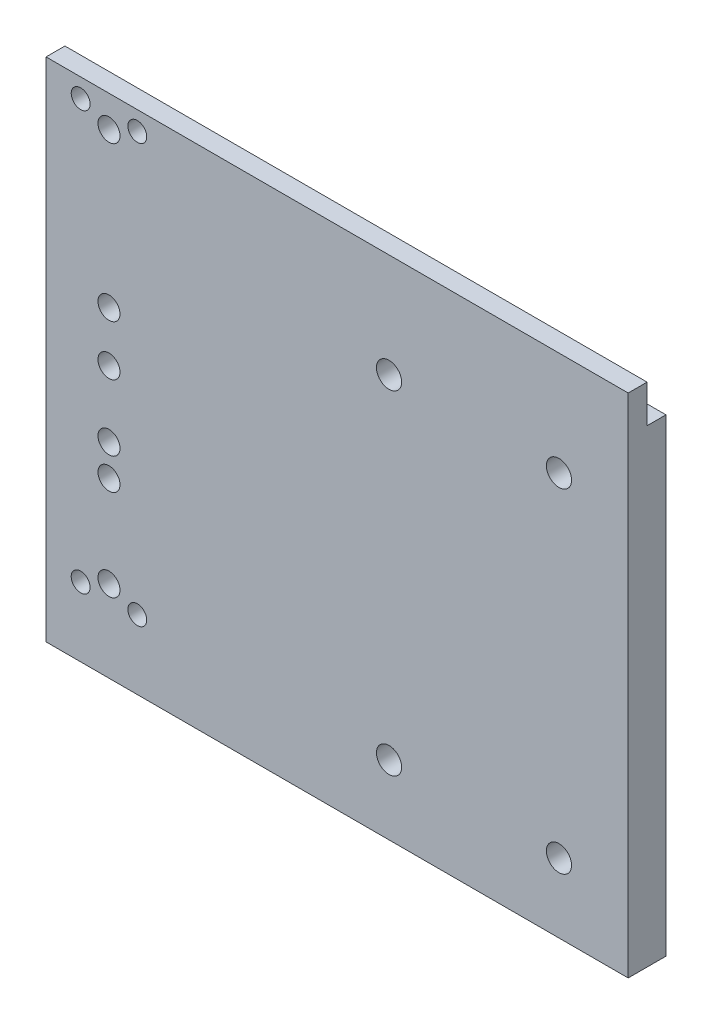
ISO-10303-21;
HEADER;
FILE_DESCRIPTION(('STEP AP214'),'2;1');
FILE_NAME('part.step','',(''),(''),'','','');
FILE_SCHEMA(('AUTOMOTIVE_DESIGN { 1 0 10303 214 1 1 1 1 }'));
ENDSEC;
DATA;
#1=APPLICATION_CONTEXT('core data for automotive mechanical design processes');
#2=APPLICATION_PROTOCOL_DEFINITION('international standard','automotive_design',2000,#1);
#3=PRODUCT_CONTEXT('',#1,'mechanical');
#4=PRODUCT('Part','Part','',(#3));
#5=PRODUCT_RELATED_PRODUCT_CATEGORY('part','',(#4));
#6=PRODUCT_DEFINITION_FORMATION('','',#4);
#7=PRODUCT_DEFINITION_CONTEXT('part definition',#1,'design');
#8=PRODUCT_DEFINITION('design','',#6,#7);
#9=PRODUCT_DEFINITION_SHAPE('','',#8);
#10=(LENGTH_UNIT() NAMED_UNIT(*) SI_UNIT(.MILLI.,.METRE.));
#11=(NAMED_UNIT(*) PLANE_ANGLE_UNIT() SI_UNIT($,.RADIAN.));
#12=(NAMED_UNIT(*) SI_UNIT($,.STERADIAN.) SOLID_ANGLE_UNIT());
#13=UNCERTAINTY_MEASURE_WITH_UNIT(LENGTH_MEASURE(1.E-05),#10,'distance_accuracy_value','');
#14=(GEOMETRIC_REPRESENTATION_CONTEXT(3) GLOBAL_UNCERTAINTY_ASSIGNED_CONTEXT((#13)) GLOBAL_UNIT_ASSIGNED_CONTEXT((#10,
#11,#12)) REPRESENTATION_CONTEXT('',''));
#15=CARTESIAN_POINT('',(0.,0.,0.));
#16=DIRECTION('',(0.,0.,1.));
#17=DIRECTION('',(1.,0.,0.));
#18=AXIS2_PLACEMENT_3D('',#15,#16,#17);
#19=CARTESIAN_POINT('',(0.,0.,-6.));
#20=DIRECTION('',(-1.,0.,0.));
#21=DIRECTION('',(0.,0.,1.));
#22=AXIS2_PLACEMENT_3D('',#19,#20,#21);
#23=PLANE('',#22);
#24=DIRECTION('',(0.,-1.,0.));
#25=VECTOR('',#24,1.);
#26=CARTESIAN_POINT('',(0.,0.,0.));
#27=LINE('',#26,#25);
#28=CARTESIAN_POINT('',(0.,149.,0.));
#29=VERTEX_POINT('',#28);
#30=CARTESIAN_POINT('',(0.,0.,0.));
#31=VERTEX_POINT('',#30);
#32=EDGE_CURVE('E78',#29,#31,#27,.T.);
#33=ORIENTED_EDGE('',*,*,#32,.F.);
#34=DIRECTION('',(0.,0.,1.));
#35=VECTOR('',#34,1.);
#36=CARTESIAN_POINT('',(0.,149.,-6.));
#37=LINE('',#36,#35);
#38=CARTESIAN_POINT('',(0.,149.,-6.));
#39=VERTEX_POINT('',#38);
#40=EDGE_CURVE('E12',#39,#29,#37,.T.);
#41=ORIENTED_EDGE('',*,*,#40,.F.);
#42=DIRECTION('',(0.,-1.,0.));
#43=VECTOR('',#42,1.);
#44=CARTESIAN_POINT('',(0.,0.,-6.));
#45=LINE('',#44,#43);
#46=CARTESIAN_POINT('',(0.,0.,-6.));
#47=VERTEX_POINT('',#46);
#48=EDGE_CURVE('E114',#39,#47,#45,.T.);
#49=ORIENTED_EDGE('',*,*,#48,.T.);
#50=DIRECTION('',(0.,0.,1.));
#51=VECTOR('',#50,1.);
#52=CARTESIAN_POINT('',(0.,0.,-6.));
#53=LINE('',#52,#51);
#54=EDGE_CURVE('E49',#47,#31,#53,.T.);
#55=ORIENTED_EDGE('',*,*,#54,.T.);
#56=EDGE_LOOP('',(#33,#41,#49,#55));
#57=FACE_BOUND('',#56,.T.);
#58=ADVANCED_FACE('F46',(#57),#23,.T.);
#59=CARTESIAN_POINT('',(0.,149.,-6.));
#60=DIRECTION('',(0.,1.,0.));
#61=DIRECTION('',(0.,0.,1.));
#62=AXIS2_PLACEMENT_3D('',#59,#60,#61);
#63=PLANE('',#62);
#64=DIRECTION('',(-1.,0.,0.));
#65=VECTOR('',#64,1.);
#66=CARTESIAN_POINT('',(0.,149.,0.));
#67=LINE('',#66,#65);
#68=CARTESIAN_POINT('',(97.,149.,0.));
#69=VERTEX_POINT('',#68);
#70=EDGE_CURVE('E117',#69,#29,#67,.T.);
#71=ORIENTED_EDGE('',*,*,#70,.F.);
#72=DIRECTION('',(0.,0.,1.));
#73=VECTOR('',#72,1.);
#74=CARTESIAN_POINT('',(97.,149.,-6.));
#75=LINE('',#74,#73);
#76=CARTESIAN_POINT('',(97.,149.,-6.));
#77=VERTEX_POINT('',#76);
#78=EDGE_CURVE('E56',#77,#69,#75,.T.);
#79=ORIENTED_EDGE('',*,*,#78,.F.);
#80=DIRECTION('',(-1.,0.,0.));
#81=VECTOR('',#80,1.);
#82=CARTESIAN_POINT('',(0.,149.,-6.));
#83=LINE('',#82,#81);
#84=EDGE_CURVE('E108',#77,#39,#83,.T.);
#85=ORIENTED_EDGE('',*,*,#84,.T.);
#86=ORIENTED_EDGE('',*,*,#40,.T.);
#87=EDGE_LOOP('',(#71,#79,#85,#86));
#88=FACE_BOUND('',#87,.T.);
#89=ADVANCED_FACE('F137',(#88),#63,.T.);
#90=CARTESIAN_POINT('',(97.,0.,-6.));
#91=DIRECTION('',(1.,0.,0.));
#92=DIRECTION('',(0.,0.,-1.));
#93=AXIS2_PLACEMENT_3D('',#90,#91,#92);
#94=PLANE('',#93);
#95=ORIENTED_EDGE('',*,*,#78,.T.);
#96=DIRECTION('',(0.,-1.,0.));
#97=VECTOR('',#96,1.);
#98=CARTESIAN_POINT('',(97.,0.,0.));
#99=LINE('',#98,#97);
#100=CARTESIAN_POINT('',(97.,161.,0.));
#101=VERTEX_POINT('',#100);
#102=EDGE_CURVE('E134',#101,#69,#99,.T.);
#103=ORIENTED_EDGE('',*,*,#102,.F.);
#104=DIRECTION('',(0.,0.,-1.));
#105=VECTOR('',#104,1.);
#106=CARTESIAN_POINT('',(97.,161.,6.));
#107=LINE('',#106,#105);
#108=CARTESIAN_POINT('',(97.,161.,6.));
#109=VERTEX_POINT('',#108);
#110=EDGE_CURVE('E171',#109,#101,#107,.T.);
#111=ORIENTED_EDGE('',*,*,#110,.F.);
#112=DIRECTION('',(0.,-1.,0.));
#113=VECTOR('',#112,1.);
#114=CARTESIAN_POINT('',(97.,0.,6.));
#115=LINE('',#114,#113);
#116=CARTESIAN_POINT('',(97.,0.,6.));
#117=VERTEX_POINT('',#116);
#118=EDGE_CURVE('E97',#109,#117,#115,.T.);
#119=ORIENTED_EDGE('',*,*,#118,.T.);
#120=DIRECTION('',(0.,0.,1.));
#121=VECTOR('',#120,1.);
#122=CARTESIAN_POINT('',(97.,0.,-6.));
#123=LINE('',#122,#121);
#124=CARTESIAN_POINT('',(97.,0.,-6.));
#125=VERTEX_POINT('',#124);
#126=EDGE_CURVE('E90',#125,#117,#123,.T.);
#127=ORIENTED_EDGE('',*,*,#126,.F.);
#128=DIRECTION('',(0.,1.,0.));
#129=VECTOR('',#128,1.);
#130=CARTESIAN_POINT('',(97.,0.,-6.));
#131=LINE('',#130,#129);
#132=EDGE_CURVE('E93',#125,#77,#131,.T.);
#133=ORIENTED_EDGE('',*,*,#132,.T.);
#134=EDGE_LOOP('',(#95,#103,#111,#119,#127,#133));
#135=FACE_BOUND('',#134,.T.);
#136=ADVANCED_FACE('F92',(#135),#94,.T.);
#137=CARTESIAN_POINT('',(0.,0.,-6.));
#138=DIRECTION('',(0.,-1.,0.));
#139=DIRECTION('',(0.,0.,-1.));
#140=AXIS2_PLACEMENT_3D('',#137,#138,#139);
#141=PLANE('',#140);
#142=ORIENTED_EDGE('',*,*,#126,.T.);
#143=DIRECTION('',(1.,0.,0.));
#144=VECTOR('',#143,1.);
#145=CARTESIAN_POINT('',(0.,0.,6.));
#146=LINE('',#145,#144);
#147=CARTESIAN_POINT('',(-88.,0.,6.));
#148=VERTEX_POINT('',#147);
#149=EDGE_CURVE('E167',#148,#117,#146,.T.);
#150=ORIENTED_EDGE('',*,*,#149,.F.);
#151=DIRECTION('',(0.,0.,-1.));
#152=VECTOR('',#151,1.);
#153=CARTESIAN_POINT('',(-88.,0.,6.));
#154=LINE('',#153,#152);
#155=CARTESIAN_POINT('',(-88.,0.,0.));
#156=VERTEX_POINT('',#155);
#157=EDGE_CURVE('E162',#148,#156,#154,.T.);
#158=ORIENTED_EDGE('',*,*,#157,.T.);
#159=DIRECTION('',(1.,0.,0.));
#160=VECTOR('',#159,1.);
#161=CARTESIAN_POINT('',(0.,0.,0.));
#162=LINE('',#161,#160);
#163=EDGE_CURVE('E158',#156,#31,#162,.T.);
#164=ORIENTED_EDGE('',*,*,#163,.T.);
#165=ORIENTED_EDGE('',*,*,#54,.F.);
#166=DIRECTION('',(1.,0.,0.));
#167=VECTOR('',#166,1.);
#168=CARTESIAN_POINT('',(0.,0.,-6.));
#169=LINE('',#168,#167);
#170=EDGE_CURVE('E106',#47,#125,#169,.T.);
#171=ORIENTED_EDGE('',*,*,#170,.T.);
#172=EDGE_LOOP('',(#142,#150,#158,#164,#165,#171));
#173=FACE_BOUND('',#172,.T.);
#174=ADVANCED_FACE('F111',(#173),#141,.T.);
#175=CARTESIAN_POINT('',(0.,0.,-6.));
#176=DIRECTION('',(0.,0.,-1.));
#177=DIRECTION('',(-1.,0.,0.));
#178=AXIS2_PLACEMENT_3D('',#175,#176,#177);
#179=PLANE('',#178);
#180=CARTESIAN_POINT('',(21.,22.,-6.));
#181=DIRECTION('',(0.,0.,1.));
#182=DIRECTION('',(1.,0.,0.));
#183=AXIS2_PLACEMENT_3D('',#180,#181,#182);
#184=CIRCLE('',#183,4.);
#185=CARTESIAN_POINT('',(25.,22.,-6.));
#186=VERTEX_POINT('',#185);
#187=EDGE_CURVE('E175',#186,#186,#184,.T.);
#188=ORIENTED_EDGE('',*,*,#187,.T.);
#189=EDGE_LOOP('',(#188));
#190=FACE_BOUND('',#189,.T.);
#191=CARTESIAN_POINT('',(75.,22.,-6.));
#192=DIRECTION('',(0.,0.,1.));
#193=DIRECTION('',(1.,0.,0.));
#194=AXIS2_PLACEMENT_3D('',#191,#192,#193);
#195=CIRCLE('',#194,4.00000000000001);
#196=CARTESIAN_POINT('',(79.,22.,-6.));
#197=VERTEX_POINT('',#196);
#198=EDGE_CURVE('E179',#197,#197,#195,.T.);
#199=ORIENTED_EDGE('',*,*,#198,.T.);
#200=EDGE_LOOP('',(#199));
#201=FACE_BOUND('',#200,.T.);
#202=CARTESIAN_POINT('',(75.,128.,-6.));
#203=DIRECTION('',(0.,0.,1.));
#204=DIRECTION('',(1.,0.,0.));
#205=AXIS2_PLACEMENT_3D('',#202,#203,#204);
#206=CIRCLE('',#205,4.00000000000001);
#207=CARTESIAN_POINT('',(79.,128.,-6.));
#208=VERTEX_POINT('',#207);
#209=EDGE_CURVE('E183',#208,#208,#206,.T.);
#210=ORIENTED_EDGE('',*,*,#209,.T.);
#211=EDGE_LOOP('',(#210));
#212=FACE_BOUND('',#211,.T.);
#213=CARTESIAN_POINT('',(21.,128.,-6.));
#214=DIRECTION('',(0.,0.,1.));
#215=DIRECTION('',(1.,0.,0.));
#216=AXIS2_PLACEMENT_3D('',#213,#214,#215);
#217=CIRCLE('',#216,4.);
#218=CARTESIAN_POINT('',(25.,128.,-6.));
#219=VERTEX_POINT('',#218);
#220=EDGE_CURVE('E125',#219,#219,#217,.T.);
#221=ORIENTED_EDGE('',*,*,#220,.T.);
#222=EDGE_LOOP('',(#221));
#223=FACE_BOUND('',#222,.T.);
#224=ORIENTED_EDGE('',*,*,#48,.F.);
#225=ORIENTED_EDGE('',*,*,#84,.F.);
#226=ORIENTED_EDGE('',*,*,#132,.F.);
#227=ORIENTED_EDGE('',*,*,#170,.F.);
#228=EDGE_LOOP('',(#224,#225,#226,#227));
#229=FACE_BOUND('',#228,.T.);
#230=ADVANCED_FACE('F105',(#190,#201,#212,#223,#229),#179,.T.);
#231=CARTESIAN_POINT('',(21.,128.,-6.));
#232=DIRECTION('',(0.,0.,1.));
#233=DIRECTION('',(1.,0.,0.));
#234=AXIS2_PLACEMENT_3D('',#231,#232,#233);
#235=CYLINDRICAL_SURFACE('',#234,4.);
#236=ORIENTED_EDGE('',*,*,#220,.F.);
#237=EDGE_LOOP('',(#236));
#238=FACE_BOUND('',#237,.T.);
#239=CARTESIAN_POINT('',(21.,128.,6.));
#240=DIRECTION('',(0.,0.,1.));
#241=DIRECTION('',(1.,0.,0.));
#242=AXIS2_PLACEMENT_3D('',#239,#240,#241);
#243=CIRCLE('',#242,4.);
#244=CARTESIAN_POINT('',(25.,128.,6.));
#245=VERTEX_POINT('',#244);
#246=EDGE_CURVE('E161',#245,#245,#243,.T.);
#247=ORIENTED_EDGE('',*,*,#246,.T.);
#248=EDGE_LOOP('',(#247));
#249=FACE_BOUND('',#248,.T.);
#250=ADVANCED_FACE('F191',(#238,#249),#235,.F.);
#251=CARTESIAN_POINT('',(75.,128.,-6.));
#252=DIRECTION('',(0.,0.,1.));
#253=DIRECTION('',(1.,0.,0.));
#254=AXIS2_PLACEMENT_3D('',#251,#252,#253);
#255=CYLINDRICAL_SURFACE('',#254,4.00000000000001);
#256=ORIENTED_EDGE('',*,*,#209,.F.);
#257=EDGE_LOOP('',(#256));
#258=FACE_BOUND('',#257,.T.);
#259=CARTESIAN_POINT('',(75.,128.,6.));
#260=DIRECTION('',(0.,0.,1.));
#261=DIRECTION('',(1.,0.,0.));
#262=AXIS2_PLACEMENT_3D('',#259,#260,#261);
#263=CIRCLE('',#262,4.00000000000001);
#264=CARTESIAN_POINT('',(79.,128.,6.));
#265=VERTEX_POINT('',#264);
#266=EDGE_CURVE('E200',#265,#265,#263,.T.);
#267=ORIENTED_EDGE('',*,*,#266,.T.);
#268=EDGE_LOOP('',(#267));
#269=FACE_BOUND('',#268,.T.);
#270=ADVANCED_FACE('F194',(#258,#269),#255,.F.);
#271=CARTESIAN_POINT('',(75.,22.,-6.));
#272=DIRECTION('',(0.,0.,1.));
#273=DIRECTION('',(1.,0.,0.));
#274=AXIS2_PLACEMENT_3D('',#271,#272,#273);
#275=CYLINDRICAL_SURFACE('',#274,4.00000000000001);
#276=ORIENTED_EDGE('',*,*,#198,.F.);
#277=EDGE_LOOP('',(#276));
#278=FACE_BOUND('',#277,.T.);
#279=CARTESIAN_POINT('',(75.,22.,6.));
#280=DIRECTION('',(0.,0.,1.));
#281=DIRECTION('',(1.,0.,0.));
#282=AXIS2_PLACEMENT_3D('',#279,#280,#281);
#283=CIRCLE('',#282,4.00000000000001);
#284=CARTESIAN_POINT('',(79.,22.,6.));
#285=VERTEX_POINT('',#284);
#286=EDGE_CURVE('E204',#285,#285,#283,.T.);
#287=ORIENTED_EDGE('',*,*,#286,.T.);
#288=EDGE_LOOP('',(#287));
#289=FACE_BOUND('',#288,.T.);
#290=ADVANCED_FACE('F371',(#278,#289),#275,.F.);
#291=CARTESIAN_POINT('',(21.,22.,-6.));
#292=DIRECTION('',(0.,0.,1.));
#293=DIRECTION('',(1.,0.,0.));
#294=AXIS2_PLACEMENT_3D('',#291,#292,#293);
#295=CYLINDRICAL_SURFACE('',#294,4.);
#296=ORIENTED_EDGE('',*,*,#187,.F.);
#297=EDGE_LOOP('',(#296));
#298=FACE_BOUND('',#297,.T.);
#299=CARTESIAN_POINT('',(21.,22.,6.));
#300=DIRECTION('',(0.,0.,1.));
#301=DIRECTION('',(1.,0.,0.));
#302=AXIS2_PLACEMENT_3D('',#299,#300,#301);
#303=CIRCLE('',#302,4.);
#304=CARTESIAN_POINT('',(25.,22.,6.));
#305=VERTEX_POINT('',#304);
#306=EDGE_CURVE('E218',#305,#305,#303,.T.);
#307=ORIENTED_EDGE('',*,*,#306,.T.);
#308=EDGE_LOOP('',(#307));
#309=FACE_BOUND('',#308,.T.);
#310=ADVANCED_FACE('F430',(#298,#309),#295,.F.);
#311=CARTESIAN_POINT('',(0.,0.,0.));
#312=DIRECTION('',(0.,0.,1.));
#313=DIRECTION('',(1.,0.,0.));
#314=AXIS2_PLACEMENT_3D('',#311,#312,#313);
#315=PLANE('',#314);
#316=CARTESIAN_POINT('',(-77.,155.,0.));
#317=DIRECTION('',(0.,0.,1.));
#318=DIRECTION('',(1.,0.,0.));
#319=AXIS2_PLACEMENT_3D('',#316,#317,#318);
#320=CIRCLE('',#319,2.99999999999999);
#321=CARTESIAN_POINT('',(-74.,155.,0.));
#322=VERTEX_POINT('',#321);
#323=EDGE_CURVE('E144',#322,#322,#320,.T.);
#324=ORIENTED_EDGE('',*,*,#323,.T.);
#325=EDGE_LOOP('',(#324));
#326=FACE_BOUND('',#325,.T.);
#327=CARTESIAN_POINT('',(-59.,22.,0.));
#328=DIRECTION('',(0.,0.,1.));
#329=DIRECTION('',(1.,0.,0.));
#330=AXIS2_PLACEMENT_3D('',#327,#328,#329);
#331=CIRCLE('',#330,3.00000000000001);
#332=CARTESIAN_POINT('',(-56.,22.,0.));
#333=VERTEX_POINT('',#332);
#334=EDGE_CURVE('E151',#333,#333,#331,.T.);
#335=ORIENTED_EDGE('',*,*,#334,.T.);
#336=EDGE_LOOP('',(#335));
#337=FACE_BOUND('',#336,.T.);
#338=CARTESIAN_POINT('',(-68.,26.,0.));
#339=DIRECTION('',(0.,0.,1.));
#340=DIRECTION('',(1.,0.,0.));
#341=AXIS2_PLACEMENT_3D('',#338,#339,#340);
#342=CIRCLE('',#341,3.50000000000001);
#343=CARTESIAN_POINT('',(-64.5,26.,0.));
#344=VERTEX_POINT('',#343);
#345=EDGE_CURVE('E321',#344,#344,#342,.T.);
#346=ORIENTED_EDGE('',*,*,#345,.T.);
#347=EDGE_LOOP('',(#346));
#348=FACE_BOUND('',#347,.T.);
#349=CARTESIAN_POINT('',(-77.,22.,0.));
#350=DIRECTION('',(0.,0.,1.));
#351=DIRECTION('',(1.,0.,0.));
#352=AXIS2_PLACEMENT_3D('',#349,#350,#351);
#353=CIRCLE('',#352,2.99999999999999);
#354=CARTESIAN_POINT('',(-74.,22.,0.));
#355=VERTEX_POINT('',#354);
#356=EDGE_CURVE('E317',#355,#355,#353,.T.);
#357=ORIENTED_EDGE('',*,*,#356,.T.);
#358=EDGE_LOOP('',(#357));
#359=FACE_BOUND('',#358,.T.);
#360=CARTESIAN_POINT('',(-68.,102.,0.));
#361=DIRECTION('',(0.,0.,1.));
#362=DIRECTION('',(1.,0.,0.));
#363=AXIS2_PLACEMENT_3D('',#360,#361,#362);
#364=CIRCLE('',#363,3.50000000000001);
#365=CARTESIAN_POINT('',(-64.5,102.,0.));
#366=VERTEX_POINT('',#365);
#367=EDGE_CURVE('E313',#366,#366,#364,.T.);
#368=ORIENTED_EDGE('',*,*,#367,.T.);
#369=EDGE_LOOP('',(#368));
#370=FACE_BOUND('',#369,.T.);
#371=CARTESIAN_POINT('',(-68.,86.,0.));
#372=DIRECTION('',(0.,0.,1.));
#373=DIRECTION('',(1.,0.,0.));
#374=AXIS2_PLACEMENT_3D('',#371,#372,#373);
#375=CIRCLE('',#374,3.50000000000001);
#376=CARTESIAN_POINT('',(-64.5,86.,0.));
#377=VERTEX_POINT('',#376);
#378=EDGE_CURVE('E309',#377,#377,#375,.T.);
#379=ORIENTED_EDGE('',*,*,#378,.T.);
#380=EDGE_LOOP('',(#379));
#381=FACE_BOUND('',#380,.T.);
#382=CARTESIAN_POINT('',(-68.,65.,0.));
#383=DIRECTION('',(0.,0.,1.));
#384=DIRECTION('',(1.,0.,0.));
#385=AXIS2_PLACEMENT_3D('',#382,#383,#384);
#386=CIRCLE('',#385,3.50000000000001);
#387=CARTESIAN_POINT('',(-64.5,65.,0.));
#388=VERTEX_POINT('',#387);
#389=EDGE_CURVE('E305',#388,#388,#386,.T.);
#390=ORIENTED_EDGE('',*,*,#389,.T.);
#391=EDGE_LOOP('',(#390));
#392=FACE_BOUND('',#391,.T.);
#393=CARTESIAN_POINT('',(-68.,55.,0.));
#394=DIRECTION('',(0.,0.,1.));
#395=DIRECTION('',(1.,0.,0.));
#396=AXIS2_PLACEMENT_3D('',#393,#394,#395);
#397=CIRCLE('',#396,3.50000000000001);
#398=CARTESIAN_POINT('',(-64.5,55.,0.));
#399=VERTEX_POINT('',#398);
#400=EDGE_CURVE('E301',#399,#399,#397,.T.);
#401=ORIENTED_EDGE('',*,*,#400,.T.);
#402=EDGE_LOOP('',(#401));
#403=FACE_BOUND('',#402,.T.);
#404=CARTESIAN_POINT('',(-59.,155.,0.));
#405=DIRECTION('',(0.,0.,1.));
#406=DIRECTION('',(1.,0.,0.));
#407=AXIS2_PLACEMENT_3D('',#404,#405,#406);
#408=CIRCLE('',#407,3.00000000000001);
#409=CARTESIAN_POINT('',(-56.,155.,0.));
#410=VERTEX_POINT('',#409);
#411=EDGE_CURVE('E297',#410,#410,#408,.T.);
#412=ORIENTED_EDGE('',*,*,#411,.T.);
#413=EDGE_LOOP('',(#412));
#414=FACE_BOUND('',#413,.T.);
#415=CARTESIAN_POINT('',(-68.,151.,0.));
#416=DIRECTION('',(0.,0.,1.));
#417=DIRECTION('',(1.,0.,0.));
#418=AXIS2_PLACEMENT_3D('',#415,#416,#417);
#419=CIRCLE('',#418,3.50000000000001);
#420=CARTESIAN_POINT('',(-64.5,151.,0.));
#421=VERTEX_POINT('',#420);
#422=EDGE_CURVE('E293',#421,#421,#419,.T.);
#423=ORIENTED_EDGE('',*,*,#422,.T.);
#424=EDGE_LOOP('',(#423));
#425=FACE_BOUND('',#424,.T.);
#426=ORIENTED_EDGE('',*,*,#70,.T.);
#427=ORIENTED_EDGE('',*,*,#32,.T.);
#428=ORIENTED_EDGE('',*,*,#163,.F.);
#429=DIRECTION('',(0.,-1.,0.));
#430=VECTOR('',#429,1.);
#431=CARTESIAN_POINT('',(-88.,0.,0.));
#432=LINE('',#431,#430);
#433=CARTESIAN_POINT('',(-88.,161.,0.));
#434=VERTEX_POINT('',#433);
#435=EDGE_CURVE('E148',#434,#156,#432,.T.);
#436=ORIENTED_EDGE('',*,*,#435,.F.);
#437=DIRECTION('',(1.,0.,0.));
#438=VECTOR('',#437,1.);
#439=CARTESIAN_POINT('',(0.,161.,0.));
#440=LINE('',#439,#438);
#441=EDGE_CURVE('E142',#434,#101,#440,.T.);
#442=ORIENTED_EDGE('',*,*,#441,.T.);
#443=ORIENTED_EDGE('',*,*,#102,.T.);
#444=EDGE_LOOP('',(#426,#427,#428,#436,#442,#443));
#445=FACE_BOUND('',#444,.T.);
#446=ADVANCED_FACE('F139',(#326,#337,#348,#359,#370,#381,#392,#403,#414,#425,#445),#315,.F.);
#447=CARTESIAN_POINT('',(0.,161.,6.));
#448=DIRECTION('',(0.,1.,0.));
#449=DIRECTION('',(0.,0.,1.));
#450=AXIS2_PLACEMENT_3D('',#447,#448,#449);
#451=PLANE('',#450);
#452=ORIENTED_EDGE('',*,*,#441,.F.);
#453=DIRECTION('',(0.,0.,-1.));
#454=VECTOR('',#453,1.);
#455=CARTESIAN_POINT('',(-88.,161.,6.));
#456=LINE('',#455,#454);
#457=CARTESIAN_POINT('',(-88.,161.,6.));
#458=VERTEX_POINT('',#457);
#459=EDGE_CURVE('E166',#458,#434,#456,.T.);
#460=ORIENTED_EDGE('',*,*,#459,.F.);
#461=DIRECTION('',(1.,0.,0.));
#462=VECTOR('',#461,1.);
#463=CARTESIAN_POINT('',(0.,161.,6.));
#464=LINE('',#463,#462);
#465=EDGE_CURVE('E281',#458,#109,#464,.T.);
#466=ORIENTED_EDGE('',*,*,#465,.T.);
#467=ORIENTED_EDGE('',*,*,#110,.T.);
#468=EDGE_LOOP('',(#452,#460,#466,#467));
#469=FACE_BOUND('',#468,.T.);
#470=ADVANCED_FACE('F413',(#469),#451,.T.);
#471=CARTESIAN_POINT('',(-88.,0.,6.));
#472=DIRECTION('',(1.,0.,0.));
#473=DIRECTION('',(0.,0.,-1.));
#474=AXIS2_PLACEMENT_3D('',#471,#472,#473);
#475=PLANE('',#474);
#476=ORIENTED_EDGE('',*,*,#435,.T.);
#477=ORIENTED_EDGE('',*,*,#157,.F.);
#478=DIRECTION('',(0.,-1.,0.));
#479=VECTOR('',#478,1.);
#480=CARTESIAN_POINT('',(-88.,0.,6.));
#481=LINE('',#480,#479);
#482=EDGE_CURVE('E286',#458,#148,#481,.T.);
#483=ORIENTED_EDGE('',*,*,#482,.F.);
#484=ORIENTED_EDGE('',*,*,#459,.T.);
#485=EDGE_LOOP('',(#476,#477,#483,#484));
#486=FACE_BOUND('',#485,.T.);
#487=ADVANCED_FACE('F343',(#486),#475,.F.);
#488=CARTESIAN_POINT('',(-77.,155.,6.));
#489=DIRECTION('',(0.,0.,-1.));
#490=DIRECTION('',(-1.,0.,0.));
#491=AXIS2_PLACEMENT_3D('',#488,#489,#490);
#492=CYLINDRICAL_SURFACE('',#491,2.99999999999999);
#493=CARTESIAN_POINT('',(-77.,155.,6.));
#494=DIRECTION('',(0.,0.,1.));
#495=DIRECTION('',(1.,0.,0.));
#496=AXIS2_PLACEMENT_3D('',#493,#494,#495);
#497=CIRCLE('',#496,2.99999999999999);
#498=CARTESIAN_POINT('',(-74.,155.,6.));
#499=VERTEX_POINT('',#498);
#500=EDGE_CURVE('E272',#499,#499,#497,.T.);
#501=ORIENTED_EDGE('',*,*,#500,.T.);
#502=EDGE_LOOP('',(#501));
#503=FACE_BOUND('',#502,.T.);
#504=ORIENTED_EDGE('',*,*,#323,.F.);
#505=EDGE_LOOP('',(#504));
#506=FACE_BOUND('',#505,.T.);
#507=ADVANCED_FACE('F333',(#503,#506),#492,.F.);
#508=CARTESIAN_POINT('',(-59.,22.,6.));
#509=DIRECTION('',(0.,0.,-1.));
#510=DIRECTION('',(-1.,0.,0.));
#511=AXIS2_PLACEMENT_3D('',#508,#509,#510);
#512=CYLINDRICAL_SURFACE('',#511,3.00000000000001);
#513=CARTESIAN_POINT('',(-59.,22.,6.));
#514=DIRECTION('',(0.,0.,1.));
#515=DIRECTION('',(1.,0.,0.));
#516=AXIS2_PLACEMENT_3D('',#513,#514,#515);
#517=CIRCLE('',#516,3.00000000000001);
#518=CARTESIAN_POINT('',(-56.,22.,6.));
#519=VERTEX_POINT('',#518);
#520=EDGE_CURVE('E267',#519,#519,#517,.T.);
#521=ORIENTED_EDGE('',*,*,#520,.T.);
#522=EDGE_LOOP('',(#521));
#523=FACE_BOUND('',#522,.T.);
#524=ORIENTED_EDGE('',*,*,#334,.F.);
#525=EDGE_LOOP('',(#524));
#526=FACE_BOUND('',#525,.T.);
#527=ADVANCED_FACE('F330',(#523,#526),#512,.F.);
#528=CARTESIAN_POINT('',(-68.,26.,6.));
#529=DIRECTION('',(0.,0.,-1.));
#530=DIRECTION('',(-1.,0.,0.));
#531=AXIS2_PLACEMENT_3D('',#528,#529,#530);
#532=CYLINDRICAL_SURFACE('',#531,3.50000000000001);
#533=CARTESIAN_POINT('',(-68.,26.,6.));
#534=DIRECTION('',(0.,0.,1.));
#535=DIRECTION('',(1.,0.,0.));
#536=AXIS2_PLACEMENT_3D('',#533,#534,#535);
#537=CIRCLE('',#536,3.50000000000001);
#538=CARTESIAN_POINT('',(-64.5,26.,6.));
#539=VERTEX_POINT('',#538);
#540=EDGE_CURVE('E262',#539,#539,#537,.T.);
#541=ORIENTED_EDGE('',*,*,#540,.T.);
#542=EDGE_LOOP('',(#541));
#543=FACE_BOUND('',#542,.T.);
#544=ORIENTED_EDGE('',*,*,#345,.F.);
#545=EDGE_LOOP('',(#544));
#546=FACE_BOUND('',#545,.T.);
#547=ADVANCED_FACE('F332',(#543,#546),#532,.F.);
#548=CARTESIAN_POINT('',(-77.,22.,6.));
#549=DIRECTION('',(0.,0.,-1.));
#550=DIRECTION('',(-1.,0.,0.));
#551=AXIS2_PLACEMENT_3D('',#548,#549,#550);
#552=CYLINDRICAL_SURFACE('',#551,2.99999999999999);
#553=CARTESIAN_POINT('',(-77.,22.,6.));
#554=DIRECTION('',(0.,0.,1.));
#555=DIRECTION('',(1.,0.,0.));
#556=AXIS2_PLACEMENT_3D('',#553,#554,#555);
#557=CIRCLE('',#556,2.99999999999999);
#558=CARTESIAN_POINT('',(-74.,22.,6.));
#559=VERTEX_POINT('',#558);
#560=EDGE_CURVE('E258',#559,#559,#557,.T.);
#561=ORIENTED_EDGE('',*,*,#560,.T.);
#562=EDGE_LOOP('',(#561));
#563=FACE_BOUND('',#562,.T.);
#564=ORIENTED_EDGE('',*,*,#356,.F.);
#565=EDGE_LOOP('',(#564));
#566=FACE_BOUND('',#565,.T.);
#567=ADVANCED_FACE('F340',(#563,#566),#552,.F.);
#568=CARTESIAN_POINT('',(-68.,102.,6.));
#569=DIRECTION('',(0.,0.,-1.));
#570=DIRECTION('',(-1.,0.,0.));
#571=AXIS2_PLACEMENT_3D('',#568,#569,#570);
#572=CYLINDRICAL_SURFACE('',#571,3.50000000000001);
#573=CARTESIAN_POINT('',(-68.,102.,6.));
#574=DIRECTION('',(0.,0.,1.));
#575=DIRECTION('',(1.,0.,0.));
#576=AXIS2_PLACEMENT_3D('',#573,#574,#575);
#577=CIRCLE('',#576,3.50000000000001);
#578=CARTESIAN_POINT('',(-64.5,102.,6.));
#579=VERTEX_POINT('',#578);
#580=EDGE_CURVE('E250',#579,#579,#577,.T.);
#581=ORIENTED_EDGE('',*,*,#580,.T.);
#582=EDGE_LOOP('',(#581));
#583=FACE_BOUND('',#582,.T.);
#584=ORIENTED_EDGE('',*,*,#367,.F.);
#585=EDGE_LOOP('',(#584));
#586=FACE_BOUND('',#585,.T.);
#587=ADVANCED_FACE('F464',(#583,#586),#572,.F.);
#588=CARTESIAN_POINT('',(-68.,86.,6.));
#589=DIRECTION('',(0.,0.,-1.));
#590=DIRECTION('',(-1.,0.,0.));
#591=AXIS2_PLACEMENT_3D('',#588,#589,#590);
#592=CYLINDRICAL_SURFACE('',#591,3.50000000000001);
#593=CARTESIAN_POINT('',(-68.,86.,6.));
#594=DIRECTION('',(0.,0.,1.));
#595=DIRECTION('',(1.,0.,0.));
#596=AXIS2_PLACEMENT_3D('',#593,#594,#595);
#597=CIRCLE('',#596,3.50000000000001);
#598=CARTESIAN_POINT('',(-64.5,86.,6.));
#599=VERTEX_POINT('',#598);
#600=EDGE_CURVE('E245',#599,#599,#597,.T.);
#601=ORIENTED_EDGE('',*,*,#600,.T.);
#602=EDGE_LOOP('',(#601));
#603=FACE_BOUND('',#602,.T.);
#604=ORIENTED_EDGE('',*,*,#378,.F.);
#605=EDGE_LOOP('',(#604));
#606=FACE_BOUND('',#605,.T.);
#607=ADVANCED_FACE('F460',(#603,#606),#592,.F.);
#608=CARTESIAN_POINT('',(-68.,65.,6.));
#609=DIRECTION('',(0.,0.,-1.));
#610=DIRECTION('',(-1.,0.,0.));
#611=AXIS2_PLACEMENT_3D('',#608,#609,#610);
#612=CYLINDRICAL_SURFACE('',#611,3.50000000000001);
#613=CARTESIAN_POINT('',(-68.,65.,6.));
#614=DIRECTION('',(0.,0.,1.));
#615=DIRECTION('',(1.,0.,0.));
#616=AXIS2_PLACEMENT_3D('',#613,#614,#615);
#617=CIRCLE('',#616,3.50000000000001);
#618=CARTESIAN_POINT('',(-64.5,65.,6.));
#619=VERTEX_POINT('',#618);
#620=EDGE_CURVE('E240',#619,#619,#617,.T.);
#621=ORIENTED_EDGE('',*,*,#620,.T.);
#622=EDGE_LOOP('',(#621));
#623=FACE_BOUND('',#622,.T.);
#624=ORIENTED_EDGE('',*,*,#389,.F.);
#625=EDGE_LOOP('',(#624));
#626=FACE_BOUND('',#625,.T.);
#627=ADVANCED_FACE('F456',(#623,#626),#612,.F.);
#628=CARTESIAN_POINT('',(-68.,55.,6.));
#629=DIRECTION('',(0.,0.,-1.));
#630=DIRECTION('',(-1.,0.,0.));
#631=AXIS2_PLACEMENT_3D('',#628,#629,#630);
#632=CYLINDRICAL_SURFACE('',#631,3.50000000000001);
#633=CARTESIAN_POINT('',(-68.,55.,6.));
#634=DIRECTION('',(0.,0.,1.));
#635=DIRECTION('',(1.,0.,0.));
#636=AXIS2_PLACEMENT_3D('',#633,#634,#635);
#637=CIRCLE('',#636,3.50000000000001);
#638=CARTESIAN_POINT('',(-64.5,55.,6.));
#639=VERTEX_POINT('',#638);
#640=EDGE_CURVE('E236',#639,#639,#637,.T.);
#641=ORIENTED_EDGE('',*,*,#640,.T.);
#642=EDGE_LOOP('',(#641));
#643=FACE_BOUND('',#642,.T.);
#644=ORIENTED_EDGE('',*,*,#400,.F.);
#645=EDGE_LOOP('',(#644));
#646=FACE_BOUND('',#645,.T.);
#647=ADVANCED_FACE('F452',(#643,#646),#632,.F.);
#648=CARTESIAN_POINT('',(-59.,155.,6.));
#649=DIRECTION('',(0.,0.,-1.));
#650=DIRECTION('',(-1.,0.,0.));
#651=AXIS2_PLACEMENT_3D('',#648,#649,#650);
#652=CYLINDRICAL_SURFACE('',#651,3.00000000000001);
#653=CARTESIAN_POINT('',(-59.,155.,6.));
#654=DIRECTION('',(0.,0.,1.));
#655=DIRECTION('',(1.,0.,0.));
#656=AXIS2_PLACEMENT_3D('',#653,#654,#655);
#657=CIRCLE('',#656,3.00000000000001);
#658=CARTESIAN_POINT('',(-56.,155.,6.));
#659=VERTEX_POINT('',#658);
#660=EDGE_CURVE('E228',#659,#659,#657,.T.);
#661=ORIENTED_EDGE('',*,*,#660,.T.);
#662=EDGE_LOOP('',(#661));
#663=FACE_BOUND('',#662,.T.);
#664=ORIENTED_EDGE('',*,*,#411,.F.);
#665=EDGE_LOOP('',(#664));
#666=FACE_BOUND('',#665,.T.);
#667=ADVANCED_FACE('F448',(#663,#666),#652,.F.);
#668=CARTESIAN_POINT('',(-68.,151.,6.));
#669=DIRECTION('',(0.,0.,-1.));
#670=DIRECTION('',(-1.,0.,0.));
#671=AXIS2_PLACEMENT_3D('',#668,#669,#670);
#672=CYLINDRICAL_SURFACE('',#671,3.50000000000001);
#673=CARTESIAN_POINT('',(-68.,151.,6.));
#674=DIRECTION('',(0.,0.,1.));
#675=DIRECTION('',(1.,0.,0.));
#676=AXIS2_PLACEMENT_3D('',#673,#674,#675);
#677=CIRCLE('',#676,3.50000000000001);
#678=CARTESIAN_POINT('',(-64.5,151.,6.));
#679=VERTEX_POINT('',#678);
#680=EDGE_CURVE('E223',#679,#679,#677,.T.);
#681=ORIENTED_EDGE('',*,*,#680,.T.);
#682=EDGE_LOOP('',(#681));
#683=FACE_BOUND('',#682,.T.);
#684=ORIENTED_EDGE('',*,*,#422,.F.);
#685=EDGE_LOOP('',(#684));
#686=FACE_BOUND('',#685,.T.);
#687=ADVANCED_FACE('F378',(#683,#686),#672,.F.);
#688=CARTESIAN_POINT('',(0.,0.,6.));
#689=DIRECTION('',(0.,0.,1.));
#690=DIRECTION('',(1.,0.,0.));
#691=AXIS2_PLACEMENT_3D('',#688,#689,#690);
#692=PLANE('',#691);
#693=ORIENTED_EDGE('',*,*,#246,.F.);
#694=EDGE_LOOP('',(#693));
#695=FACE_BOUND('',#694,.T.);
#696=ORIENTED_EDGE('',*,*,#266,.F.);
#697=EDGE_LOOP('',(#696));
#698=FACE_BOUND('',#697,.T.);
#699=ORIENTED_EDGE('',*,*,#286,.F.);
#700=EDGE_LOOP('',(#699));
#701=FACE_BOUND('',#700,.T.);
#702=ORIENTED_EDGE('',*,*,#306,.F.);
#703=EDGE_LOOP('',(#702));
#704=FACE_BOUND('',#703,.T.);
#705=ORIENTED_EDGE('',*,*,#680,.F.);
#706=EDGE_LOOP('',(#705));
#707=FACE_BOUND('',#706,.T.);
#708=ORIENTED_EDGE('',*,*,#660,.F.);
#709=EDGE_LOOP('',(#708));
#710=FACE_BOUND('',#709,.T.);
#711=ORIENTED_EDGE('',*,*,#640,.F.);
#712=EDGE_LOOP('',(#711));
#713=FACE_BOUND('',#712,.T.);
#714=ORIENTED_EDGE('',*,*,#620,.F.);
#715=EDGE_LOOP('',(#714));
#716=FACE_BOUND('',#715,.T.);
#717=ORIENTED_EDGE('',*,*,#600,.F.);
#718=EDGE_LOOP('',(#717));
#719=FACE_BOUND('',#718,.T.);
#720=ORIENTED_EDGE('',*,*,#580,.F.);
#721=EDGE_LOOP('',(#720));
#722=FACE_BOUND('',#721,.T.);
#723=ORIENTED_EDGE('',*,*,#560,.F.);
#724=EDGE_LOOP('',(#723));
#725=FACE_BOUND('',#724,.T.);
#726=ORIENTED_EDGE('',*,*,#540,.F.);
#727=EDGE_LOOP('',(#726));
#728=FACE_BOUND('',#727,.T.);
#729=ORIENTED_EDGE('',*,*,#520,.F.);
#730=EDGE_LOOP('',(#729));
#731=FACE_BOUND('',#730,.T.);
#732=ORIENTED_EDGE('',*,*,#500,.F.);
#733=EDGE_LOOP('',(#732));
#734=FACE_BOUND('',#733,.T.);
#735=ORIENTED_EDGE('',*,*,#118,.F.);
#736=ORIENTED_EDGE('',*,*,#465,.F.);
#737=ORIENTED_EDGE('',*,*,#482,.T.);
#738=ORIENTED_EDGE('',*,*,#149,.T.);
#739=EDGE_LOOP('',(#735,#736,#737,#738));
#740=FACE_BOUND('',#739,.T.);
#741=ADVANCED_FACE('F375',(#695,#698,#701,#704,#707,#710,#713,#716,#719,#722,#725,#728,#731,
#734,#740),#692,.T.);
#742=CLOSED_SHELL('',(#58,#89,#136,#174,#230,#250,#270,#290,#310,#446,#470,#487,#507,#527,#547,
#567,#587,#607,#627,#647,#667,#687,#741));
#743=MANIFOLD_SOLID_BREP('B2',#742);
#744=ADVANCED_BREP_SHAPE_REPRESENTATION('',(#18,#743),#14);
#745=SHAPE_DEFINITION_REPRESENTATION(#9,#744);
ENDSEC;
END-ISO-10303-21;
